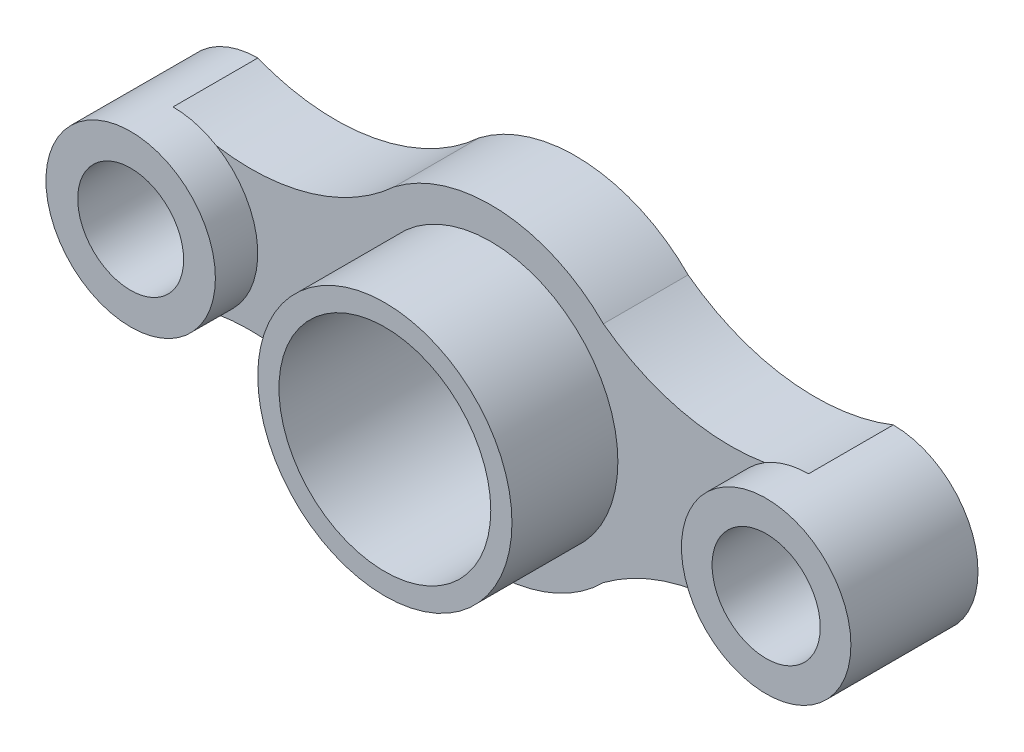
ISO-10303-21;
HEADER;
FILE_DESCRIPTION(('STEP AP214'),'2;1');
FILE_NAME('part.step','',(''),(''),'','','');
FILE_SCHEMA(('AUTOMOTIVE_DESIGN { 1 0 10303 214 1 1 1 1 }'));
ENDSEC;
DATA;
#1=APPLICATION_CONTEXT('core data for automotive mechanical design processes');
#2=APPLICATION_PROTOCOL_DEFINITION('international standard','automotive_design',2000,#1);
#3=PRODUCT_CONTEXT('',#1,'mechanical');
#4=PRODUCT('Part','Part','',(#3));
#5=PRODUCT_RELATED_PRODUCT_CATEGORY('part','',(#4));
#6=PRODUCT_DEFINITION_FORMATION('','',#4);
#7=PRODUCT_DEFINITION_CONTEXT('part definition',#1,'design');
#8=PRODUCT_DEFINITION('design','',#6,#7);
#9=PRODUCT_DEFINITION_SHAPE('','',#8);
#10=(LENGTH_UNIT() NAMED_UNIT(*) SI_UNIT(.MILLI.,.METRE.));
#11=(NAMED_UNIT(*) PLANE_ANGLE_UNIT() SI_UNIT($,.RADIAN.));
#12=(NAMED_UNIT(*) SI_UNIT($,.STERADIAN.) SOLID_ANGLE_UNIT());
#13=UNCERTAINTY_MEASURE_WITH_UNIT(LENGTH_MEASURE(1.E-05),#10,'distance_accuracy_value','');
#14=(GEOMETRIC_REPRESENTATION_CONTEXT(3) GLOBAL_UNCERTAINTY_ASSIGNED_CONTEXT((#13)) GLOBAL_UNIT_ASSIGNED_CONTEXT((#10,
#11,#12)) REPRESENTATION_CONTEXT('',''));
#15=CARTESIAN_POINT('',(0.,0.,0.));
#16=DIRECTION('',(0.,0.,1.));
#17=DIRECTION('',(1.,0.,0.));
#18=AXIS2_PLACEMENT_3D('',#15,#16,#17);
#19=CARTESIAN_POINT('',(0.,0.,40.));
#20=DIRECTION('',(0.,0.,1.));
#21=DIRECTION('',(1.,0.,0.));
#22=AXIS2_PLACEMENT_3D('',#19,#20,#21);
#23=PLANE('',#22);
#24=CARTESIAN_POINT('',(0.,0.,40.));
#25=DIRECTION('',(0.,0.,1.));
#26=DIRECTION('',(1.,0.,0.));
#27=AXIS2_PLACEMENT_3D('',#24,#25,#26);
#28=CIRCLE('',#27,60.);
#29=CARTESIAN_POINT('',(60.,0.,40.));
#30=VERTEX_POINT('',#29);
#31=EDGE_CURVE('E450',#30,#30,#28,.T.);
#32=ORIENTED_EDGE('',*,*,#31,.F.);
#33=EDGE_LOOP('',(#32));
#34=FACE_BOUND('',#33,.T.);
#35=CARTESIAN_POINT('',(113.106431946841,-132.945492824058,40.));
#36=DIRECTION('',(0.,0.,1.));
#37=DIRECTION('',(1.,0.,0.));
#38=AXIS2_PLACEMENT_3D('',#35,#36,#37);
#39=CIRCLE('',#38,100.);
#40=CARTESIAN_POINT('',(53.1614363963828,-52.9042690174749,40.));
#41=VERTEX_POINT('',#40);
#42=CARTESIAN_POINT('',(129.386734631314,-34.2796337617562,40.));
#43=VERTEX_POINT('',#42);
#44=EDGE_CURVE('E142',#41,#43,#39,.F.);
#45=ORIENTED_EDGE('',*,*,#44,.T.);
#46=CARTESIAN_POINT('',(150.,0.,40.));
#47=DIRECTION('',(0.,0.,1.));
#48=DIRECTION('',(1.,0.,0.));
#49=AXIS2_PLACEMENT_3D('',#46,#47,#48);
#50=CIRCLE('',#49,40.);
#51=CARTESIAN_POINT('',(129.386734631314,34.2796337617562,40.));
#52=VERTEX_POINT('',#51);
#53=EDGE_CURVE('E11',#43,#52,#50,.F.);
#54=ORIENTED_EDGE('',*,*,#53,.T.);
#55=CARTESIAN_POINT('',(113.106431946841,132.945492824058,40.));
#56=DIRECTION('',(0.,0.,1.));
#57=DIRECTION('',(1.,0.,0.));
#58=AXIS2_PLACEMENT_3D('',#55,#56,#57);
#59=CIRCLE('',#58,100.);
#60=CARTESIAN_POINT('',(53.1614363963826,52.904269017475,40.));
#61=VERTEX_POINT('',#60);
#62=EDGE_CURVE('E139',#61,#52,#59,.T.);
#63=ORIENTED_EDGE('',*,*,#62,.F.);
#64=CARTESIAN_POINT('',(0.,0.,40.));
#65=DIRECTION('',(0.,0.,1.));
#66=DIRECTION('',(1.,0.,0.));
#67=AXIS2_PLACEMENT_3D('',#64,#65,#66);
#68=CIRCLE('',#67,75.);
#69=CARTESIAN_POINT('',(-45.4653658777927,59.6481391629148,40.));
#70=VERTEX_POINT('',#69);
#71=EDGE_CURVE('E186',#61,#70,#68,.T.);
#72=ORIENTED_EDGE('',*,*,#71,.T.);
#73=CARTESIAN_POINT('',(-113.376065803047,133.052068455985,40.));
#74=DIRECTION('',(0.,0.,1.));
#75=DIRECTION('',(1.,0.,0.));
#76=AXIS2_PLACEMENT_3D('',#73,#74,#75);
#77=CIRCLE('',#76,100.);
#78=CARTESIAN_POINT('',(-129.530149720999,34.3654656531131,40.));
#79=VERTEX_POINT('',#78);
#80=EDGE_CURVE('E175',#79,#70,#77,.T.);
#81=ORIENTED_EDGE('',*,*,#80,.F.);
#82=CARTESIAN_POINT('',(-150.,0.,40.));
#83=DIRECTION('',(0.,0.,1.));
#84=DIRECTION('',(1.,0.,0.));
#85=AXIS2_PLACEMENT_3D('',#82,#83,#84);
#86=CIRCLE('',#85,40.);
#87=CARTESIAN_POINT('',(-129.530149720999,-34.3654656531131,40.));
#88=VERTEX_POINT('',#87);
#89=EDGE_CURVE('E51',#88,#79,#86,.T.);
#90=ORIENTED_EDGE('',*,*,#89,.F.);
#91=CARTESIAN_POINT('',(-113.376065803047,-133.052068455985,40.));
#92=DIRECTION('',(0.,0.,1.));
#93=DIRECTION('',(1.,0.,0.));
#94=AXIS2_PLACEMENT_3D('',#91,#92,#93);
#95=CIRCLE('',#94,100.);
#96=CARTESIAN_POINT('',(-45.4653658777927,-59.6481391629148,40.));
#97=VERTEX_POINT('',#96);
#98=EDGE_CURVE('E174',#88,#97,#95,.F.);
#99=ORIENTED_EDGE('',*,*,#98,.T.);
#100=CARTESIAN_POINT('',(0.,0.,40.));
#101=DIRECTION('',(0.,0.,1.));
#102=DIRECTION('',(1.,0.,0.));
#103=AXIS2_PLACEMENT_3D('',#100,#101,#102);
#104=CIRCLE('',#103,75.);
#105=EDGE_CURVE('E180',#97,#41,#104,.T.);
#106=ORIENTED_EDGE('',*,*,#105,.T.);
#107=EDGE_LOOP('',(#45,#54,#63,#72,#81,#90,#99,#106));
#108=FACE_BOUND('',#107,.T.);
#109=ADVANCED_FACE('F41',(#34,#108),#23,.T.);
#110=CARTESIAN_POINT('',(-113.376065803047,133.052068455985,40.));
#111=DIRECTION('',(0.,0.,-1.));
#112=DIRECTION('',(-1.,0.,0.));
#113=AXIS2_PLACEMENT_3D('',#110,#111,#112);
#114=CYLINDRICAL_SURFACE('',#113,100.);
#115=CARTESIAN_POINT('',(-113.376065803047,133.052068455985,0.));
#116=DIRECTION('',(0.,0.,1.));
#117=DIRECTION('',(1.,0.,0.));
#118=AXIS2_PLACEMENT_3D('',#115,#116,#117);
#119=CIRCLE('',#118,100.);
#120=CARTESIAN_POINT('',(-150.,40.,0.));
#121=VERTEX_POINT('',#120);
#122=CARTESIAN_POINT('',(-45.4653658777927,59.6481391629148,0.));
#123=VERTEX_POINT('',#122);
#124=EDGE_CURVE('E166',#121,#123,#119,.T.);
#125=ORIENTED_EDGE('',*,*,#124,.F.);
#126=DIRECTION('',(0.,0.,-1.));
#127=VECTOR('',#126,1.);
#128=CARTESIAN_POINT('',(-150.,40.,40.));
#129=LINE('',#128,#127);
#130=CARTESIAN_POINT('',(-150.,40.,40.));
#131=VERTEX_POINT('',#130);
#132=EDGE_CURVE('E241',#131,#121,#129,.T.);
#133=ORIENTED_EDGE('',*,*,#132,.F.);
#134=EDGE_CURVE('E171',#131,#79,#77,.T.);
#135=ORIENTED_EDGE('',*,*,#134,.T.);
#136=ORIENTED_EDGE('',*,*,#80,.T.);
#137=DIRECTION('',(0.,0.,-1.));
#138=VECTOR('',#137,1.);
#139=CARTESIAN_POINT('',(-45.4653658777927,59.6481391629148,40.));
#140=LINE('',#139,#138);
#141=EDGE_CURVE('E190',#70,#123,#140,.T.);
#142=ORIENTED_EDGE('',*,*,#141,.T.);
#143=EDGE_LOOP('',(#125,#133,#135,#136,#142));
#144=FACE_BOUND('',#143,.T.);
#145=ADVANCED_FACE('F43',(#144),#114,.F.);
#146=CARTESIAN_POINT('',(-150.,0.,40.));
#147=DIRECTION('',(0.,0.,-1.));
#148=DIRECTION('',(-1.,0.,0.));
#149=AXIS2_PLACEMENT_3D('',#146,#147,#148);
#150=CYLINDRICAL_SURFACE('',#149,40.);
#151=CARTESIAN_POINT('',(-150.,0.,0.));
#152=DIRECTION('',(0.,0.,1.));
#153=DIRECTION('',(1.,0.,0.));
#154=AXIS2_PLACEMENT_3D('',#151,#152,#153);
#155=CIRCLE('',#154,40.);
#156=CARTESIAN_POINT('',(-150.,-40.,0.));
#157=VERTEX_POINT('',#156);
#158=EDGE_CURVE('E194',#121,#157,#155,.T.);
#159=ORIENTED_EDGE('',*,*,#158,.T.);
#160=DIRECTION('',(0.,0.,-1.));
#161=VECTOR('',#160,1.);
#162=CARTESIAN_POINT('',(-150.,-40.,40.));
#163=LINE('',#162,#161);
#164=CARTESIAN_POINT('',(-150.,-40.,40.));
#165=VERTEX_POINT('',#164);
#166=EDGE_CURVE('E237',#165,#157,#163,.T.);
#167=ORIENTED_EDGE('',*,*,#166,.F.);
#168=EDGE_CURVE('E161',#165,#88,#86,.T.);
#169=ORIENTED_EDGE('',*,*,#168,.T.);
#170=ORIENTED_EDGE('',*,*,#89,.T.);
#171=EDGE_CURVE('E167',#79,#131,#86,.T.);
#172=ORIENTED_EDGE('',*,*,#171,.T.);
#173=ORIENTED_EDGE('',*,*,#132,.T.);
#174=EDGE_LOOP('',(#159,#167,#169,#170,#172,#173));
#175=FACE_BOUND('',#174,.T.);
#176=CARTESIAN_POINT('',(-150.,0.,60.));
#177=DIRECTION('',(0.,0.,1.));
#178=DIRECTION('',(1.,0.,0.));
#179=AXIS2_PLACEMENT_3D('',#176,#177,#178);
#180=CIRCLE('',#179,40.);
#181=CARTESIAN_POINT('',(-110.,0.,60.));
#182=VERTEX_POINT('',#181);
#183=EDGE_CURVE('E162',#182,#182,#180,.T.);
#184=ORIENTED_EDGE('',*,*,#183,.F.);
#185=EDGE_LOOP('',(#184));
#186=FACE_BOUND('',#185,.T.);
#187=ADVANCED_FACE('F251',(#175,#186),#150,.T.);
#188=CARTESIAN_POINT('',(-113.376065803047,-133.052068455985,40.));
#189=DIRECTION('',(0.,0.,-1.));
#190=DIRECTION('',(-1.,0.,0.));
#191=AXIS2_PLACEMENT_3D('',#188,#189,#190);
#192=CYLINDRICAL_SURFACE('',#191,100.);
#193=CARTESIAN_POINT('',(-113.376065803047,-133.052068455985,0.));
#194=DIRECTION('',(0.,0.,1.));
#195=DIRECTION('',(1.,0.,0.));
#196=AXIS2_PLACEMENT_3D('',#193,#194,#195);
#197=CIRCLE('',#196,100.);
#198=CARTESIAN_POINT('',(-45.4653658777927,-59.6481391629148,0.));
#199=VERTEX_POINT('',#198);
#200=EDGE_CURVE('E197',#157,#199,#197,.F.);
#201=ORIENTED_EDGE('',*,*,#200,.T.);
#202=DIRECTION('',(0.,0.,-1.));
#203=VECTOR('',#202,1.);
#204=CARTESIAN_POINT('',(-45.4653658777927,-59.6481391629148,40.));
#205=LINE('',#204,#203);
#206=EDGE_CURVE('E233',#97,#199,#205,.T.);
#207=ORIENTED_EDGE('',*,*,#206,.F.);
#208=ORIENTED_EDGE('',*,*,#98,.F.);
#209=EDGE_CURVE('E176',#165,#88,#95,.F.);
#210=ORIENTED_EDGE('',*,*,#209,.F.);
#211=ORIENTED_EDGE('',*,*,#166,.T.);
#212=EDGE_LOOP('',(#201,#207,#208,#210,#211));
#213=FACE_BOUND('',#212,.T.);
#214=ADVANCED_FACE('F258',(#213),#192,.F.);
#215=CARTESIAN_POINT('',(0.,0.,40.));
#216=DIRECTION('',(0.,0.,-1.));
#217=DIRECTION('',(-1.,0.,0.));
#218=AXIS2_PLACEMENT_3D('',#215,#216,#217);
#219=CYLINDRICAL_SURFACE('',#218,75.);
#220=CARTESIAN_POINT('',(0.,0.,0.));
#221=DIRECTION('',(0.,0.,1.));
#222=DIRECTION('',(1.,0.,0.));
#223=AXIS2_PLACEMENT_3D('',#220,#221,#222);
#224=CIRCLE('',#223,75.);
#225=CARTESIAN_POINT('',(53.1614363963828,-52.9042690174749,0.));
#226=VERTEX_POINT('',#225);
#227=EDGE_CURVE('E200',#199,#226,#224,.T.);
#228=ORIENTED_EDGE('',*,*,#227,.T.);
#229=DIRECTION('',(0.,0.,-1.));
#230=VECTOR('',#229,1.);
#231=CARTESIAN_POINT('',(53.1614363963828,-52.9042690174749,40.));
#232=LINE('',#231,#230);
#233=EDGE_CURVE('E229',#41,#226,#232,.T.);
#234=ORIENTED_EDGE('',*,*,#233,.F.);
#235=ORIENTED_EDGE('',*,*,#105,.F.);
#236=ORIENTED_EDGE('',*,*,#206,.T.);
#237=EDGE_LOOP('',(#228,#234,#235,#236));
#238=FACE_BOUND('',#237,.T.);
#239=ADVANCED_FACE('F320',(#238),#219,.T.);
#240=CARTESIAN_POINT('',(113.106431946841,-132.945492824058,40.));
#241=DIRECTION('',(0.,0.,-1.));
#242=DIRECTION('',(-1.,0.,0.));
#243=AXIS2_PLACEMENT_3D('',#240,#241,#242);
#244=CYLINDRICAL_SURFACE('',#243,100.);
#245=CARTESIAN_POINT('',(113.106431946841,-132.945492824058,0.));
#246=DIRECTION('',(0.,0.,1.));
#247=DIRECTION('',(1.,0.,0.));
#248=AXIS2_PLACEMENT_3D('',#245,#246,#247);
#249=CIRCLE('',#248,100.);
#250=CARTESIAN_POINT('',(150.,-40.,0.));
#251=VERTEX_POINT('',#250);
#252=EDGE_CURVE('E203',#226,#251,#249,.F.);
#253=ORIENTED_EDGE('',*,*,#252,.T.);
#254=DIRECTION('',(0.,0.,-1.));
#255=VECTOR('',#254,1.);
#256=CARTESIAN_POINT('',(150.,-40.,40.));
#257=LINE('',#256,#255);
#258=CARTESIAN_POINT('',(150.,-40.,40.));
#259=VERTEX_POINT('',#258);
#260=EDGE_CURVE('E133',#259,#251,#257,.T.);
#261=ORIENTED_EDGE('',*,*,#260,.F.);
#262=EDGE_CURVE('E64',#43,#259,#39,.F.);
#263=ORIENTED_EDGE('',*,*,#262,.F.);
#264=ORIENTED_EDGE('',*,*,#44,.F.);
#265=ORIENTED_EDGE('',*,*,#233,.T.);
#266=EDGE_LOOP('',(#253,#261,#263,#264,#265));
#267=FACE_BOUND('',#266,.T.);
#268=ADVANCED_FACE('F317',(#267),#244,.F.);
#269=CARTESIAN_POINT('',(150.,0.,40.));
#270=DIRECTION('',(0.,0.,-1.));
#271=DIRECTION('',(-1.,0.,0.));
#272=AXIS2_PLACEMENT_3D('',#269,#270,#271);
#273=CYLINDRICAL_SURFACE('',#272,40.);
#274=CARTESIAN_POINT('',(150.,0.,0.));
#275=DIRECTION('',(0.,0.,1.));
#276=DIRECTION('',(1.,0.,0.));
#277=AXIS2_PLACEMENT_3D('',#274,#275,#276);
#278=CIRCLE('',#277,40.);
#279=CARTESIAN_POINT('',(150.,40.,0.));
#280=VERTEX_POINT('',#279);
#281=EDGE_CURVE('E128',#251,#280,#278,.T.);
#282=ORIENTED_EDGE('',*,*,#281,.T.);
#283=DIRECTION('',(0.,0.,-1.));
#284=VECTOR('',#283,1.);
#285=CARTESIAN_POINT('',(150.,40.,40.));
#286=LINE('',#285,#284);
#287=CARTESIAN_POINT('',(150.,40.,40.));
#288=VERTEX_POINT('',#287);
#289=EDGE_CURVE('E120',#288,#280,#286,.T.);
#290=ORIENTED_EDGE('',*,*,#289,.F.);
#291=CARTESIAN_POINT('',(150.,0.,40.));
#292=DIRECTION('',(0.,0.,1.));
#293=DIRECTION('',(1.,0.,0.));
#294=AXIS2_PLACEMENT_3D('',#291,#292,#293);
#295=CIRCLE('',#294,40.);
#296=EDGE_CURVE('E125',#288,#52,#295,.T.);
#297=ORIENTED_EDGE('',*,*,#296,.T.);
#298=ORIENTED_EDGE('',*,*,#53,.F.);
#299=EDGE_CURVE('E147',#43,#259,#295,.T.);
#300=ORIENTED_EDGE('',*,*,#299,.T.);
#301=ORIENTED_EDGE('',*,*,#260,.T.);
#302=EDGE_LOOP('',(#282,#290,#297,#298,#300,#301));
#303=FACE_BOUND('',#302,.T.);
#304=CARTESIAN_POINT('',(150.,0.,60.));
#305=DIRECTION('',(0.,0.,1.));
#306=DIRECTION('',(1.,0.,0.));
#307=AXIS2_PLACEMENT_3D('',#304,#305,#306);
#308=CIRCLE('',#307,40.);
#309=CARTESIAN_POINT('',(190.,0.,60.));
#310=VERTEX_POINT('',#309);
#311=EDGE_CURVE('E146',#310,#310,#308,.T.);
#312=ORIENTED_EDGE('',*,*,#311,.F.);
#313=EDGE_LOOP('',(#312));
#314=FACE_BOUND('',#313,.T.);
#315=ADVANCED_FACE('F122',(#303,#314),#273,.T.);
#316=CARTESIAN_POINT('',(113.106431946841,132.945492824058,40.));
#317=DIRECTION('',(0.,0.,-1.));
#318=DIRECTION('',(-1.,0.,0.));
#319=AXIS2_PLACEMENT_3D('',#316,#317,#318);
#320=CYLINDRICAL_SURFACE('',#319,100.);
#321=CARTESIAN_POINT('',(113.106431946841,132.945492824058,0.));
#322=DIRECTION('',(0.,0.,1.));
#323=DIRECTION('',(1.,0.,0.));
#324=AXIS2_PLACEMENT_3D('',#321,#322,#323);
#325=CIRCLE('',#324,100.);
#326=CARTESIAN_POINT('',(53.1614363963826,52.904269017475,0.));
#327=VERTEX_POINT('',#326);
#328=EDGE_CURVE('E208',#327,#280,#325,.T.);
#329=ORIENTED_EDGE('',*,*,#328,.F.);
#330=DIRECTION('',(0.,0.,-1.));
#331=VECTOR('',#330,1.);
#332=CARTESIAN_POINT('',(53.1614363963826,52.904269017475,40.));
#333=LINE('',#332,#331);
#334=EDGE_CURVE('E134',#61,#327,#333,.T.);
#335=ORIENTED_EDGE('',*,*,#334,.F.);
#336=ORIENTED_EDGE('',*,*,#62,.T.);
#337=EDGE_CURVE('E137',#52,#288,#59,.T.);
#338=ORIENTED_EDGE('',*,*,#337,.T.);
#339=ORIENTED_EDGE('',*,*,#289,.T.);
#340=EDGE_LOOP('',(#329,#335,#336,#338,#339));
#341=FACE_BOUND('',#340,.T.);
#342=ADVANCED_FACE('F138',(#341),#320,.F.);
#343=CARTESIAN_POINT('',(150.,0.,40.));
#344=DIRECTION('',(0.,0.,-1.));
#345=DIRECTION('',(-1.,0.,0.));
#346=AXIS2_PLACEMENT_3D('',#343,#344,#345);
#347=CYLINDRICAL_SURFACE('',#346,25.5318257859023);
#348=CARTESIAN_POINT('',(150.,0.,0.));
#349=DIRECTION('',(0.,0.,1.));
#350=DIRECTION('',(1.,0.,0.));
#351=AXIS2_PLACEMENT_3D('',#348,#349,#350);
#352=CIRCLE('',#351,25.5318257859023);
#353=CARTESIAN_POINT('',(175.531825785902,0.,0.));
#354=VERTEX_POINT('',#353);
#355=EDGE_CURVE('E215',#354,#354,#352,.T.);
#356=ORIENTED_EDGE('',*,*,#355,.F.);
#357=EDGE_LOOP('',(#356));
#358=FACE_BOUND('',#357,.T.);
#359=CARTESIAN_POINT('',(150.,0.,60.));
#360=DIRECTION('',(0.,0.,1.));
#361=DIRECTION('',(1.,0.,0.));
#362=AXIS2_PLACEMENT_3D('',#359,#360,#361);
#363=CIRCLE('',#362,25.5318257859024);
#364=CARTESIAN_POINT('',(175.531825785902,0.,60.));
#365=VERTEX_POINT('',#364);
#366=EDGE_CURVE('E155',#365,#365,#363,.T.);
#367=ORIENTED_EDGE('',*,*,#366,.T.);
#368=EDGE_LOOP('',(#367));
#369=FACE_BOUND('',#368,.T.);
#370=ADVANCED_FACE('F307',(#358,#369),#347,.F.);
#371=CARTESIAN_POINT('',(0.,0.,40.));
#372=DIRECTION('',(0.,0.,-1.));
#373=DIRECTION('',(-1.,0.,0.));
#374=AXIS2_PLACEMENT_3D('',#371,#372,#373);
#375=CYLINDRICAL_SURFACE('',#374,75.);
#376=CARTESIAN_POINT('',(0.,0.,0.));
#377=DIRECTION('',(0.,0.,1.));
#378=DIRECTION('',(1.,0.,0.));
#379=AXIS2_PLACEMENT_3D('',#376,#377,#378);
#380=CIRCLE('',#379,75.);
#381=EDGE_CURVE('E211',#327,#123,#380,.T.);
#382=ORIENTED_EDGE('',*,*,#381,.T.);
#383=ORIENTED_EDGE('',*,*,#141,.F.);
#384=ORIENTED_EDGE('',*,*,#71,.F.);
#385=ORIENTED_EDGE('',*,*,#334,.T.);
#386=EDGE_LOOP('',(#382,#383,#384,#385));
#387=FACE_BOUND('',#386,.T.);
#388=ADVANCED_FACE('F271',(#387),#375,.T.);
#389=CARTESIAN_POINT('',(-150.,0.,40.));
#390=DIRECTION('',(0.,0.,-1.));
#391=DIRECTION('',(-1.,0.,0.));
#392=AXIS2_PLACEMENT_3D('',#389,#390,#391);
#393=CYLINDRICAL_SURFACE('',#392,25.);
#394=CARTESIAN_POINT('',(-150.,0.,0.));
#395=DIRECTION('',(0.,0.,1.));
#396=DIRECTION('',(1.,0.,0.));
#397=AXIS2_PLACEMENT_3D('',#394,#395,#396);
#398=CIRCLE('',#397,25.);
#399=CARTESIAN_POINT('',(-125.,0.,0.));
#400=VERTEX_POINT('',#399);
#401=EDGE_CURVE('E219',#400,#400,#398,.T.);
#402=ORIENTED_EDGE('',*,*,#401,.F.);
#403=EDGE_LOOP('',(#402));
#404=FACE_BOUND('',#403,.T.);
#405=CARTESIAN_POINT('',(-150.,0.,60.));
#406=DIRECTION('',(0.,0.,1.));
#407=DIRECTION('',(1.,0.,0.));
#408=AXIS2_PLACEMENT_3D('',#405,#406,#407);
#409=CIRCLE('',#408,25.);
#410=CARTESIAN_POINT('',(-125.,0.,60.));
#411=VERTEX_POINT('',#410);
#412=EDGE_CURVE('E152',#411,#411,#409,.T.);
#413=ORIENTED_EDGE('',*,*,#412,.T.);
#414=EDGE_LOOP('',(#413));
#415=FACE_BOUND('',#414,.T.);
#416=ADVANCED_FACE('F302',(#404,#415),#393,.F.);
#417=CARTESIAN_POINT('',(0.,0.,0.));
#418=DIRECTION('',(0.,0.,1.));
#419=DIRECTION('',(1.,0.,0.));
#420=AXIS2_PLACEMENT_3D('',#417,#418,#419);
#421=PLANE('',#420);
#422=CARTESIAN_POINT('',(0.,0.,0.));
#423=DIRECTION('',(0.,0.,1.));
#424=DIRECTION('',(1.,0.,0.));
#425=AXIS2_PLACEMENT_3D('',#422,#423,#424);
#426=CIRCLE('',#425,50.);
#427=CARTESIAN_POINT('',(50.,0.,0.));
#428=VERTEX_POINT('',#427);
#429=EDGE_CURVE('E45',#428,#428,#426,.T.);
#430=ORIENTED_EDGE('',*,*,#429,.T.);
#431=EDGE_LOOP('',(#430));
#432=FACE_BOUND('',#431,.T.);
#433=ORIENTED_EDGE('',*,*,#124,.T.);
#434=ORIENTED_EDGE('',*,*,#381,.F.);
#435=ORIENTED_EDGE('',*,*,#328,.T.);
#436=ORIENTED_EDGE('',*,*,#281,.F.);
#437=ORIENTED_EDGE('',*,*,#252,.F.);
#438=ORIENTED_EDGE('',*,*,#227,.F.);
#439=ORIENTED_EDGE('',*,*,#200,.F.);
#440=ORIENTED_EDGE('',*,*,#158,.F.);
#441=EDGE_LOOP('',(#433,#434,#435,#436,#437,#438,#439,#440));
#442=FACE_BOUND('',#441,.T.);
#443=ORIENTED_EDGE('',*,*,#355,.T.);
#444=EDGE_LOOP('',(#443));
#445=FACE_BOUND('',#444,.T.);
#446=ORIENTED_EDGE('',*,*,#401,.T.);
#447=EDGE_LOOP('',(#446));
#448=FACE_BOUND('',#447,.T.);
#449=ADVANCED_FACE('F274',(#432,#442,#445,#448),#421,.F.);
#450=CARTESIAN_POINT('',(-150.,0.,40.));
#451=DIRECTION('',(0.,0.,1.));
#452=DIRECTION('',(1.,0.,0.));
#453=AXIS2_PLACEMENT_3D('',#450,#451,#452);
#454=PLANE('',#453);
#455=ORIENTED_EDGE('',*,*,#168,.F.);
#456=ORIENTED_EDGE('',*,*,#209,.T.);
#457=EDGE_LOOP('',(#455,#456));
#458=FACE_BOUND('',#457,.T.);
#459=ADVANCED_FACE('F255',(#458),#454,.F.);
#460=CARTESIAN_POINT('',(-150.,0.,60.));
#461=DIRECTION('',(0.,0.,1.));
#462=DIRECTION('',(1.,0.,0.));
#463=AXIS2_PLACEMENT_3D('',#460,#461,#462);
#464=PLANE('',#463);
#465=ORIENTED_EDGE('',*,*,#183,.T.);
#466=EDGE_LOOP('',(#465));
#467=FACE_BOUND('',#466,.T.);
#468=ORIENTED_EDGE('',*,*,#412,.F.);
#469=EDGE_LOOP('',(#468));
#470=FACE_BOUND('',#469,.T.);
#471=ADVANCED_FACE('F280',(#467,#470),#464,.T.);
#472=ORIENTED_EDGE('',*,*,#134,.F.);
#473=ORIENTED_EDGE('',*,*,#171,.F.);
#474=EDGE_LOOP('',(#472,#473));
#475=FACE_BOUND('',#474,.T.);
#476=ADVANCED_FACE('F277',(#475),#454,.F.);
#477=CARTESIAN_POINT('',(150.,0.,40.));
#478=DIRECTION('',(0.,0.,1.));
#479=DIRECTION('',(1.,0.,0.));
#480=AXIS2_PLACEMENT_3D('',#477,#478,#479);
#481=PLANE('',#480);
#482=ORIENTED_EDGE('',*,*,#299,.F.);
#483=ORIENTED_EDGE('',*,*,#262,.T.);
#484=EDGE_LOOP('',(#482,#483));
#485=FACE_BOUND('',#484,.T.);
#486=ADVANCED_FACE('F279',(#485),#481,.F.);
#487=CARTESIAN_POINT('',(150.,0.,60.));
#488=DIRECTION('',(0.,0.,1.));
#489=DIRECTION('',(1.,0.,0.));
#490=AXIS2_PLACEMENT_3D('',#487,#488,#489);
#491=PLANE('',#490);
#492=ORIENTED_EDGE('',*,*,#311,.T.);
#493=EDGE_LOOP('',(#492));
#494=FACE_BOUND('',#493,.T.);
#495=ORIENTED_EDGE('',*,*,#366,.F.);
#496=EDGE_LOOP('',(#495));
#497=FACE_BOUND('',#496,.T.);
#498=ADVANCED_FACE('F286',(#494,#497),#491,.T.);
#499=ORIENTED_EDGE('',*,*,#337,.F.);
#500=ORIENTED_EDGE('',*,*,#296,.F.);
#501=EDGE_LOOP('',(#499,#500));
#502=FACE_BOUND('',#501,.T.);
#503=ADVANCED_FACE('F144',(#502),#481,.F.);
#504=CARTESIAN_POINT('',(0.,0.,90.));
#505=DIRECTION('',(0.,0.,1.));
#506=DIRECTION('',(1.,0.,0.));
#507=AXIS2_PLACEMENT_3D('',#504,#505,#506);
#508=PLANE('',#507);
#509=CARTESIAN_POINT('',(0.,0.,90.));
#510=DIRECTION('',(0.,0.,1.));
#511=DIRECTION('',(1.,0.,0.));
#512=AXIS2_PLACEMENT_3D('',#509,#510,#511);
#513=CIRCLE('',#512,60.);
#514=CARTESIAN_POINT('',(60.,0.,90.));
#515=VERTEX_POINT('',#514);
#516=EDGE_CURVE('E454',#515,#515,#513,.T.);
#517=ORIENTED_EDGE('',*,*,#516,.T.);
#518=EDGE_LOOP('',(#517));
#519=FACE_BOUND('',#518,.T.);
#520=CARTESIAN_POINT('',(0.,0.,90.));
#521=DIRECTION('',(0.,0.,1.));
#522=DIRECTION('',(1.,0.,0.));
#523=AXIS2_PLACEMENT_3D('',#520,#521,#522);
#524=CIRCLE('',#523,50.);
#525=CARTESIAN_POINT('',(50.,0.,90.));
#526=VERTEX_POINT('',#525);
#527=EDGE_CURVE('E445',#526,#526,#524,.T.);
#528=ORIENTED_EDGE('',*,*,#527,.F.);
#529=EDGE_LOOP('',(#528));
#530=FACE_BOUND('',#529,.T.);
#531=ADVANCED_FACE('F403',(#519,#530),#508,.T.);
#532=CARTESIAN_POINT('',(0.,0.,90.));
#533=DIRECTION('',(0.,0.,-1.));
#534=DIRECTION('',(-1.,0.,0.));
#535=AXIS2_PLACEMENT_3D('',#532,#533,#534);
#536=CYLINDRICAL_SURFACE('',#535,60.);
#537=ORIENTED_EDGE('',*,*,#516,.F.);
#538=EDGE_LOOP('',(#537));
#539=FACE_BOUND('',#538,.T.);
#540=ORIENTED_EDGE('',*,*,#31,.T.);
#541=EDGE_LOOP('',(#540));
#542=FACE_BOUND('',#541,.T.);
#543=ADVANCED_FACE('F416',(#539,#542),#536,.T.);
#544=CARTESIAN_POINT('',(0.,0.,90.));
#545=DIRECTION('',(0.,0.,-1.));
#546=DIRECTION('',(-1.,0.,0.));
#547=AXIS2_PLACEMENT_3D('',#544,#545,#546);
#548=CYLINDRICAL_SURFACE('',#547,50.);
#549=ORIENTED_EDGE('',*,*,#527,.T.);
#550=EDGE_LOOP('',(#549));
#551=FACE_BOUND('',#550,.T.);
#552=ORIENTED_EDGE('',*,*,#429,.F.);
#553=EDGE_LOOP('',(#552));
#554=FACE_BOUND('',#553,.T.);
#555=ADVANCED_FACE('F425',(#551,#554),#548,.F.);
#556=CLOSED_SHELL('',(#109,#145,#187,#214,#239,#268,#315,#342,#370,#388,#416,#449,#459,#471,
#476,#486,#498,#503,#531,#543,#555));
#557=MANIFOLD_SOLID_BREP('B2',#556);
#558=ADVANCED_BREP_SHAPE_REPRESENTATION('',(#18,#557),#14);
#559=SHAPE_DEFINITION_REPRESENTATION(#9,#558);
ENDSEC;
END-ISO-10303-21;
